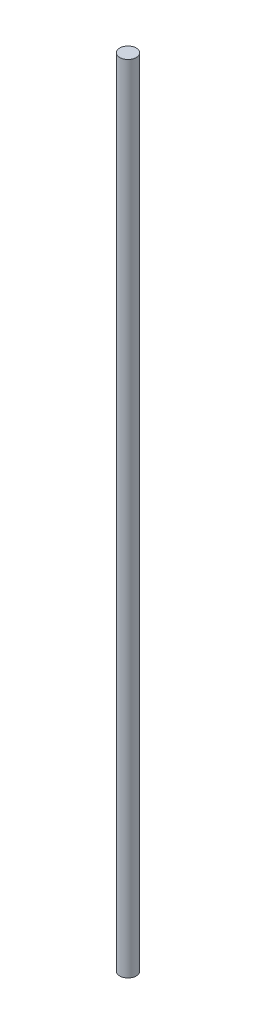
ISO-10303-21;
HEADER;
FILE_DESCRIPTION(('STEP AP214'),'2;1');
FILE_NAME('part.step','',(''),(''),'','','');
FILE_SCHEMA(('AUTOMOTIVE_DESIGN { 1 0 10303 214 1 1 1 1 }'));
ENDSEC;
DATA;
#1=APPLICATION_CONTEXT('core data for automotive mechanical design processes');
#2=APPLICATION_PROTOCOL_DEFINITION('international standard','automotive_design',2000,#1);
#3=PRODUCT_CONTEXT('',#1,'mechanical');
#4=PRODUCT('Part','Part','',(#3));
#5=PRODUCT_RELATED_PRODUCT_CATEGORY('part','',(#4));
#6=PRODUCT_DEFINITION_FORMATION('','',#4);
#7=PRODUCT_DEFINITION_CONTEXT('part definition',#1,'design');
#8=PRODUCT_DEFINITION('design','',#6,#7);
#9=PRODUCT_DEFINITION_SHAPE('','',#8);
#10=(LENGTH_UNIT() NAMED_UNIT(*) SI_UNIT(.MILLI.,.METRE.));
#11=(NAMED_UNIT(*) PLANE_ANGLE_UNIT() SI_UNIT($,.RADIAN.));
#12=(NAMED_UNIT(*) SI_UNIT($,.STERADIAN.) SOLID_ANGLE_UNIT());
#13=UNCERTAINTY_MEASURE_WITH_UNIT(LENGTH_MEASURE(1.E-05),#10,'distance_accuracy_value','');
#14=(GEOMETRIC_REPRESENTATION_CONTEXT(3) GLOBAL_UNCERTAINTY_ASSIGNED_CONTEXT((#13)) GLOBAL_UNIT_ASSIGNED_CONTEXT((#10,
#11,#12)) REPRESENTATION_CONTEXT('',''));
#15=CARTESIAN_POINT('',(0.,0.,0.));
#16=DIRECTION('',(0.,0.,1.));
#17=DIRECTION('',(1.,0.,0.));
#18=AXIS2_PLACEMENT_3D('',#15,#16,#17);
#19=CARTESIAN_POINT('',(0.,385.,0.));
#20=DIRECTION('',(0.,-1.,0.));
#21=DIRECTION('',(0.,0.,-1.));
#22=AXIS2_PLACEMENT_3D('',#19,#20,#21);
#23=CYLINDRICAL_SURFACE('',#22,4.);
#24=CARTESIAN_POINT('',(0.,385.,0.));
#25=DIRECTION('',(0.,1.,0.));
#26=DIRECTION('',(0.,0.,1.));
#27=AXIS2_PLACEMENT_3D('',#24,#25,#26);
#28=CIRCLE('',#27,4.);
#29=CARTESIAN_POINT('',(0.,385.,4.));
#30=VERTEX_POINT('',#29);
#31=EDGE_CURVE('E10',#30,#30,#28,.T.);
#32=ORIENTED_EDGE('',*,*,#31,.F.);
#33=EDGE_LOOP('',(#32));
#34=FACE_BOUND('',#33,.T.);
#35=CARTESIAN_POINT('',(0.,0.,0.));
#36=DIRECTION('',(0.,1.,0.));
#37=DIRECTION('',(0.,0.,1.));
#38=AXIS2_PLACEMENT_3D('',#35,#36,#37);
#39=CIRCLE('',#38,4.);
#40=CARTESIAN_POINT('',(0.,0.,4.));
#41=VERTEX_POINT('',#40);
#42=EDGE_CURVE('E34',#41,#41,#39,.T.);
#43=ORIENTED_EDGE('',*,*,#42,.T.);
#44=EDGE_LOOP('',(#43));
#45=FACE_BOUND('',#44,.T.);
#46=ADVANCED_FACE('F31',(#34,#45),#23,.T.);
#47=CARTESIAN_POINT('',(0.,385.,0.));
#48=DIRECTION('',(0.,1.,0.));
#49=DIRECTION('',(0.,0.,1.));
#50=AXIS2_PLACEMENT_3D('',#47,#48,#49);
#51=PLANE('',#50);
#52=ORIENTED_EDGE('',*,*,#31,.T.);
#53=EDGE_LOOP('',(#52));
#54=FACE_BOUND('',#53,.T.);
#55=ADVANCED_FACE('F46',(#54),#51,.T.);
#56=CARTESIAN_POINT('',(0.,0.,0.));
#57=DIRECTION('',(0.,1.,0.));
#58=DIRECTION('',(0.,0.,1.));
#59=AXIS2_PLACEMENT_3D('',#56,#57,#58);
#60=PLANE('',#59);
#61=ORIENTED_EDGE('',*,*,#42,.F.);
#62=EDGE_LOOP('',(#61));
#63=FACE_BOUND('',#62,.T.);
#64=ADVANCED_FACE('F44',(#63),#60,.F.);
#65=CLOSED_SHELL('',(#46,#55,#64));
#66=MANIFOLD_SOLID_BREP('B2',#65);
#67=ADVANCED_BREP_SHAPE_REPRESENTATION('',(#18,#66),#14);
#68=SHAPE_DEFINITION_REPRESENTATION(#9,#67);
ENDSEC;
END-ISO-10303-21;
